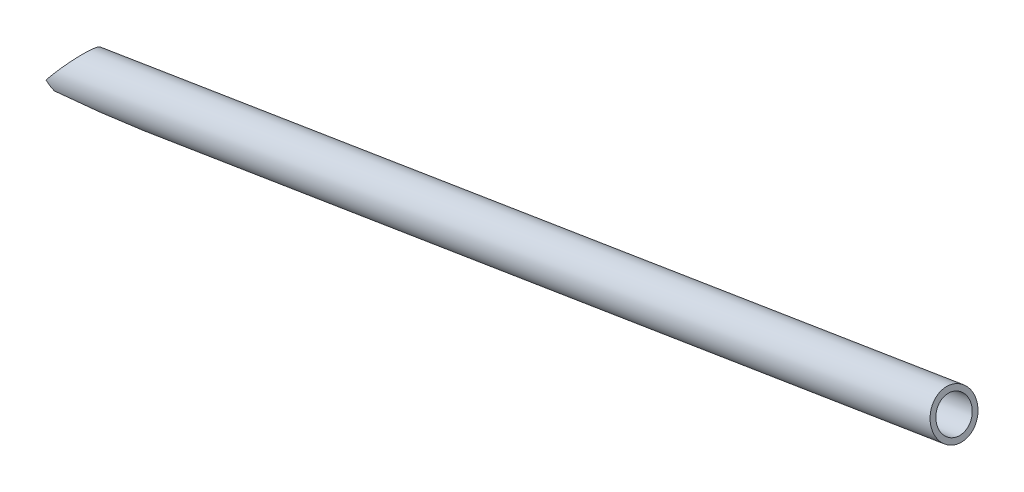
ISO-10303-21;
HEADER;
FILE_DESCRIPTION(('STEP AP214'),'2;1');
FILE_NAME('part.step','',(''),(''),'','','');
FILE_SCHEMA(('AUTOMOTIVE_DESIGN { 1 0 10303 214 1 1 1 1 }'));
ENDSEC;
DATA;
#1=APPLICATION_CONTEXT('core data for automotive mechanical design processes');
#2=APPLICATION_PROTOCOL_DEFINITION('international standard','automotive_design',2000,#1);
#3=PRODUCT_CONTEXT('',#1,'mechanical');
#4=PRODUCT('Part','Part','',(#3));
#5=PRODUCT_RELATED_PRODUCT_CATEGORY('part','',(#4));
#6=PRODUCT_DEFINITION_FORMATION('','',#4);
#7=PRODUCT_DEFINITION_CONTEXT('part definition',#1,'design');
#8=PRODUCT_DEFINITION('design','',#6,#7);
#9=PRODUCT_DEFINITION_SHAPE('','',#8);
#10=(LENGTH_UNIT() NAMED_UNIT(*) SI_UNIT(.MILLI.,.METRE.));
#11=(NAMED_UNIT(*) PLANE_ANGLE_UNIT() SI_UNIT($,.RADIAN.));
#12=(NAMED_UNIT(*) SI_UNIT($,.STERADIAN.) SOLID_ANGLE_UNIT());
#13=UNCERTAINTY_MEASURE_WITH_UNIT(LENGTH_MEASURE(1.E-05),#10,'distance_accuracy_value','');
#14=(GEOMETRIC_REPRESENTATION_CONTEXT(3) GLOBAL_UNCERTAINTY_ASSIGNED_CONTEXT((#13)) GLOBAL_UNIT_ASSIGNED_CONTEXT((#10,
#11,#12)) REPRESENTATION_CONTEXT('',''));
#15=CARTESIAN_POINT('',(0.,0.,0.));
#16=DIRECTION('',(0.,0.,1.));
#17=DIRECTION('',(1.,0.,0.));
#18=AXIS2_PLACEMENT_3D('',#15,#16,#17);
#19=CARTESIAN_POINT('',(1.11022302462516E-13,0.,200.));
#20=DIRECTION('',(0.974346253790714,0.214414809831036,0.0683788494281786));
#21=DIRECTION('',(-0.214917840654041,0.976632132263016,0.));
#22=AXIS2_PLACEMENT_3D('',#19,#20,#21);
#23=CYLINDRICAL_SURFACE('',#22,9.64999999999999);
#24=CARTESIAN_POINT('',(12.657848165168,12.6663837757625,201.033866445705));
#25=CARTESIAN_POINT('',(12.6754852969952,12.670267892202,200.817962669183));
#26=CARTESIAN_POINT('',(12.687592032191,12.6654475263971,200.601479552875));
#27=CARTESIAN_POINT('',(12.7007141875833,12.638523414575,200.169174249629));
#28=CARTESIAN_POINT('',(12.7017259689614,12.6164140008057,199.953352302735));
#29=CARTESIAN_POINT('',(12.6928978972254,12.5553665255426,199.524078278938));
#30=CARTESIAN_POINT('',(12.6830448100684,12.5164079759855,199.310629412783));
#31=CARTESIAN_POINT('',(12.6530021284405,12.4224960842971,198.888058418631));
#32=CARTESIAN_POINT('',(12.6328130614765,12.3675435584958,198.678936070393));
#33=CARTESIAN_POINT('',(12.5830320600362,12.243184894706,198.268006854536));
#34=CARTESIAN_POINT('',(12.5535148210002,12.1738950347901,198.066155597168));
#35=CARTESIAN_POINT('',(12.4858919172012,12.0217614179797,197.669092329484));
#36=CARTESIAN_POINT('',(12.447782977421,11.9389124958994,197.473882883662));
#37=CARTESIAN_POINT('',(12.3219341907085,11.6717883085674,196.89946271389));
#38=CARTESIAN_POINT('',(12.2226442596147,11.468867642128,196.531241749801));
#39=CARTESIAN_POINT('',(12.0316060655805,11.0842553958153,195.925453749268));
#40=CARTESIAN_POINT('',(11.9453209343831,10.91212601697,195.679846866211));
#41=CARTESIAN_POINT('',(11.7633134569783,10.5493905147042,195.206391270707));
#42=CARTESIAN_POINT('',(11.6675910839366,10.3587843387457,194.978542608757));
#43=CARTESIAN_POINT('',(11.4690610515366,9.96101997894277,194.540268125786));
#44=CARTESIAN_POINT('',(11.3662391268434,9.75382832807187,194.329879370938));
#45=CARTESIAN_POINT('',(11.1561166203957,9.32502507307062,193.926888893094));
#46=CARTESIAN_POINT('',(11.0488165553767,9.10341513103559,193.734285126072));
#47=CARTESIAN_POINT('',(10.8289801630034,8.64046845812747,193.361372645541));
#48=CARTESIAN_POINT('',(10.7163820687469,8.39874712577531,193.181578732136));
#49=CARTESIAN_POINT('',(10.4916151560703,7.90231270031796,192.840551125452));
#50=CARTESIAN_POINT('',(10.3794463991996,7.64759781431844,192.67932000358));
#51=CARTESIAN_POINT('',(10.1585685259634,7.12595405745613,192.375783109446));
#52=CARTESIAN_POINT('',(10.0498570573465,6.85903380588485,192.233464250728));
#53=CARTESIAN_POINT('',(9.83922076496434,6.31316264002374,191.968289535191));
#54=CARTESIAN_POINT('',(9.73729399139708,6.03421522043333,191.845428072539));
#55=CARTESIAN_POINT('',(9.57047290019094,5.54167367208223,191.650883437746));
#56=CARTESIAN_POINT('',(9.50303018067841,5.33086341131199,191.57435553236));
#57=CARTESIAN_POINT('',(9.37581635364825,4.90317076918427,191.433023906388));
#58=CARTESIAN_POINT('',(9.31604509781582,4.68628850531749,191.368219959128));
#59=CARTESIAN_POINT('',(9.15160880875329,4.02730802877123,191.192962312236));
#60=CARTESIAN_POINT('',(9.06144948682961,3.57583876087093,191.101244616923));
#61=CARTESIAN_POINT('',(8.97577033685186,2.93201498308204,191.015197637156));
#62=CARTESIAN_POINT('',(8.95588857677276,2.74596800194406,190.995420446076));
#63=CARTESIAN_POINT('',(8.92662025858535,2.37226878285702,190.966401216281));
#64=CARTESIAN_POINT('',(8.91722787463907,2.18461749436526,190.957153329495));
#65=CARTESIAN_POINT('',(8.9097824107179,1.80905100842609,190.949817507622));
#66=CARTESIAN_POINT('',(8.91171782718196,1.6211362723883,190.951718250927));
#67=CARTESIAN_POINT('',(8.92731018355185,1.24625414074607,190.967101487222));
#68=CARTESIAN_POINT('',(8.94096712902547,1.05928674559166,190.980583985713));
#69=CARTESIAN_POINT('',(8.97991455492612,0.687489382956031,191.01936046835));
#70=CARTESIAN_POINT('',(9.00522424573735,0.502663463668033,191.044673957779));
#71=CARTESIAN_POINT('',(9.06681305387757,0.136872736743957,191.10703570765));
#72=CARTESIAN_POINT('',(9.1030922202112,-0.0440920536391802,191.144084020517));
#73=CARTESIAN_POINT('',(9.18555958718107,-0.401254556927476,191.229651059047));
#74=CARTESIAN_POINT('',(9.23176218203105,-0.577444921801709,191.278186457591));
#75=CARTESIAN_POINT('',(9.33263534026653,-0.923960892723459,191.38621015946));
#76=CARTESIAN_POINT('',(9.38730810309086,-1.09428496139519,191.445701308411));
#77=CARTESIAN_POINT('',(9.52087381528293,-1.4782069213988,191.594307053623));
#78=CARTESIAN_POINT('',(9.60213445933264,-1.68961151358125,191.686970030302));
#79=CARTESIAN_POINT('',(9.77298568619439,-2.10101241056311,191.888514167262));
#80=CARTESIAN_POINT('',(9.86257895681247,-2.30100500046087,191.997400567503));
#81=CARTESIAN_POINT('',(10.0471440872052,-2.68964539689294,192.230379286382));
#82=CARTESIAN_POINT('',(10.1421222750033,-2.87827929544429,192.35448970323));
#83=CARTESIAN_POINT('',(10.3346687900217,-3.24398655328794,192.616836779603));
#84=CARTESIAN_POINT('',(10.432236937378,-3.42106071242621,192.755072460068));
#85=CARTESIAN_POINT('',(10.6302469377256,-3.76832748768761,193.048738097051));
#86=CARTESIAN_POINT('',(10.7306961138509,-3.93821118703156,193.204527959343));
#87=CARTESIAN_POINT('',(10.9296761212004,-4.26593746353563,193.529414802733));
#88=CARTESIAN_POINT('',(11.0282069546279,-4.42378005452549,193.698511768547));
#89=CARTESIAN_POINT('',(11.221393921876,-4.72732273014252,194.049334917178));
#90=CARTESIAN_POINT('',(11.3160502341815,-4.87302337442551,194.231060517198));
#91=CARTESIAN_POINT('',(11.4997202170597,-5.15204586566136,194.6064747587));
#92=CARTESIAN_POINT('',(11.5887337870685,-5.28536749201734,194.800163613268));
#93=CARTESIAN_POINT('',(11.7745249052481,-5.56162127137581,195.233914899582));
#94=CARTESIAN_POINT('',(11.8699109411979,-5.70211401694958,195.476138738318));
#95=CARTESIAN_POINT('',(12.048162615045,-5.96464239802318,195.974840419486));
#96=CARTESIAN_POINT('',(12.1310267599506,-6.08667583261123,196.231319956655));
#97=CARTESIAN_POINT('',(12.2819546322827,-6.31124777852025,196.756808713));
#98=CARTESIAN_POINT('',(12.35002236117,-6.41379155957007,197.025814520688));
#99=CARTESIAN_POINT('',(12.4693686655423,-6.59834253262544,197.574386494805));
#100=CARTESIAN_POINT('',(12.5206497605536,-6.68035280609528,197.853951069424));
#101=CARTESIAN_POINT('',(12.6010833501426,-6.81660628665564,198.396496064464));
#102=CARTESIAN_POINT('',(12.6317752082778,-6.87264686504241,198.65879763247));
#103=CARTESIAN_POINT('',(12.6768028120194,-6.96610068542239,199.188093314851));
#104=CARTESIAN_POINT('',(12.6911393670858,-7.00351484922619,199.455087196329));
#105=CARTESIAN_POINT('',(12.7028257800838,-7.05920581180806,199.991257529388));
#106=CARTESIAN_POINT('',(12.7001870149056,-7.07749541834401,200.260432398458));
#107=CARTESIAN_POINT('',(12.6777224541967,-7.09472605759301,200.798676180139));
#108=CARTESIAN_POINT('',(12.6578980603119,-7.09366866808983,201.067745099601));
#109=CARTESIAN_POINT('',(12.6043015208981,-7.07337718559519,201.574620264416));
#110=CARTESIAN_POINT('',(12.5722488163337,-7.05610016870809,201.812690956057));
#111=CARTESIAN_POINT('',(12.4950285866947,-7.0063320831581,202.285064966595));
#112=CARTESIAN_POINT('',(12.4498622194777,-6.97384235753062,202.519368616172));
#113=CARTESIAN_POINT('',(12.3470733567039,-6.89399113972104,202.982629751483));
#114=CARTESIAN_POINT('',(12.2894511612864,-6.84663000587242,203.211587365888));
#115=CARTESIAN_POINT('',(12.1626131988353,-6.73749471041387,203.662752495432));
#116=CARTESIAN_POINT('',(12.0933969981372,-6.67572000964217,203.884959757711));
#117=CARTESIAN_POINT('',(11.9436778465763,-6.53762710135798,204.323513792904));
#118=CARTESIAN_POINT('',(11.8630714479886,-6.46117299157532,204.539782321164));
#119=CARTESIAN_POINT('',(11.692289550137,-6.29471221418746,204.963110304137));
#120=CARTESIAN_POINT('',(11.6021140777158,-6.20470558459893,205.170169784681));
#121=CARTESIAN_POINT('',(11.4134646716672,-6.01169492196573,205.574276913209));
#122=CARTESIAN_POINT('',(11.3149883085275,-5.90868707929612,205.771321602816));
#123=CARTESIAN_POINT('',(11.1111357691073,-5.69022619477957,206.154656715818));
#124=CARTESIAN_POINT('',(11.0057589196984,-5.57477193809845,206.340946086708));
#125=CARTESIAN_POINT('',(10.7777141657784,-5.31856774651254,206.722010309178));
#126=CARTESIAN_POINT('',(10.6544168322438,-5.17643226006651,206.915478172531));
#127=CARTESIAN_POINT('',(10.4032278554856,-4.87788113941168,207.28788763306));
#128=CARTESIAN_POINT('',(10.2753357011349,-4.72146391350242,207.466827606892));
#129=CARTESIAN_POINT('',(10.0171562660308,-4.39453630523217,207.809780975575));
#130=CARTESIAN_POINT('',(9.88686728586113,-4.2240155980851,207.973783247038));
#131=CARTESIAN_POINT('',(9.62652996395328,-3.86910352104385,208.286208382021));
#132=CARTESIAN_POINT('',(9.49648159627687,-3.68471374773046,208.434633034108));
#133=CARTESIAN_POINT('',(9.25361789511525,-3.32302093532176,208.699957780578));
#134=CARTESIAN_POINT('',(9.14047787128656,-3.14716168728862,208.81852989279));
#135=CARTESIAN_POINT('',(8.91901082493826,-2.78429490902679,209.042457426952));
#136=CARTESIAN_POINT('',(8.81068394129518,-2.59728705748459,209.147812467701));
#137=CARTESIAN_POINT('',(8.60171787932793,-2.21240262403463,209.344571447791));
#138=CARTESIAN_POINT('',(8.50106667414862,-2.01454391683933,209.435997446312));
#139=CARTESIAN_POINT('',(8.31033157004587,-1.60787973124984,209.604404048217));
#140=CARTESIAN_POINT('',(8.22024453856257,-1.3990775246041,209.681388937858));
#141=CARTESIAN_POINT('',(8.07219799572401,-1.01814953533025,209.804936372095));
#142=CARTESIAN_POINT('',(8.01152738662136,-0.848036954497815,209.854467253069));
#143=CARTESIAN_POINT('',(7.90019825042097,-0.502123554917211,209.943941452427));
#144=CARTESIAN_POINT('',(7.84953721424909,-0.326324174555271,209.983887174039));
#145=CARTESIAN_POINT('',(7.75968346630133,0.0298789983831765,210.053882904637));
#146=CARTESIAN_POINT('',(7.7204761110397,0.210276588312629,210.083945555312));
#147=CARTESIAN_POINT('',(7.65452056150057,0.574711547408665,210.134102751716));
#148=CARTESIAN_POINT('',(7.62777240264866,0.758748926922818,210.154197269102));
#149=CARTESIAN_POINT('',(7.58729736710546,1.12933701155678,210.184476530198));
#150=CARTESIAN_POINT('',(7.57359003057456,1.31589106480192,210.194646403566));
#151=CARTESIAN_POINT('',(7.55928496846903,1.68976150279357,210.205257868046));
#152=CARTESIAN_POINT('',(7.55868719735125,1.87707788488945,210.205699492955));
#153=CARTESIAN_POINT('',(7.57007812713593,2.25126812774638,210.197252738259));
#154=CARTESIAN_POINT('',(7.58207838098105,2.43814142453817,210.188355794777));
#155=CARTESIAN_POINT('',(7.61773354362025,2.81021036406976,210.161723258219));
#156=CARTESIAN_POINT('',(7.64139531066782,2.99540495419567,210.143982463916));
#157=CARTESIAN_POINT('',(7.71032373626974,3.43413181077307,210.091751442174));
#158=CARTESIAN_POINT('',(7.76040396532063,3.68645830062254,210.053439615003));
#159=CARTESIAN_POINT('',(7.87712333147059,4.1844542800869,209.962247733673));
#160=CARTESIAN_POINT('',(7.94376372615572,4.43012326255573,209.909366573079));
#161=CARTESIAN_POINT('',(8.09048153877835,4.91483857610279,209.789947598085));
#162=CARTESIAN_POINT('',(8.17059998894754,5.15386200490303,209.723367937953));
#163=CARTESIAN_POINT('',(8.34116361501561,5.62413483013557,209.577452321735));
#164=CARTESIAN_POINT('',(8.43160870112228,5.85538429414147,209.498116476565));
#165=CARTESIAN_POINT('',(8.66224985763888,6.41106151823796,209.289197596));
#166=CARTESIAN_POINT('',(8.80669543990857,6.73123636832925,209.152951333516));
#167=CARTESIAN_POINT('',(9.10574976650321,7.35491620776174,208.855499648973));
#168=CARTESIAN_POINT('',(9.26036331945248,7.65841318346253,208.694282368093));
#169=CARTESIAN_POINT('',(9.57466628494203,8.24772414482963,208.34689305478));
#170=CARTESIAN_POINT('',(9.73435274415617,8.53354814371304,208.16073534609));
#171=CARTESIAN_POINT('',(10.0545253322407,9.08619591870411,207.762841654706));
#172=CARTESIAN_POINT('',(10.2150110783647,9.35302799910387,207.551116961846));
#173=CARTESIAN_POINT('',(10.4931035163631,9.80155444800179,207.157339786608));
#174=CARTESIAN_POINT('',(10.611422455241,9.98788573232563,206.981055422251));
#175=CARTESIAN_POINT('',(10.8444945432767,10.3472860038503,206.613194308935));
#176=CARTESIAN_POINT('',(10.9592477346205,10.5203551479894,206.421617740993));
#177=CARTESIAN_POINT('',(11.1831567308115,10.8512977391196,206.02321751645));
#178=CARTESIAN_POINT('',(11.2923203442298,11.0091926707726,205.816416171779));
#179=CARTESIAN_POINT('',(11.5031998383121,11.3079908568909,205.387344787793));
#180=CARTESIAN_POINT('',(11.6049184595258,11.4489003762788,205.165080499853));
#181=CARTESIAN_POINT('',(11.7768359798297,11.6816923565197,204.757456260285));
#182=CARTESIAN_POINT('',(11.8489604874108,11.7774553331454,204.575119144998));
#183=CARTESIAN_POINT('',(11.9863896171809,11.9561724531027,204.201901159135));
#184=CARTESIAN_POINT('',(12.0516980845563,12.0391338310809,204.011025193433));
#185=CARTESIAN_POINT('',(12.1743843772026,12.1909637141055,203.621597467278));
#186=CARTESIAN_POINT('',(12.231773473511,12.2598523164121,203.423057141255));
#187=CARTESIAN_POINT('',(12.3376871344589,12.3824764680831,203.019116826723));
#188=CARTESIAN_POINT('',(12.3862146464146,12.4362170588403,202.813719145917));
#189=CARTESIAN_POINT('',(12.4834127196024,12.5378845454177,202.349994413075));
#190=CARTESIAN_POINT('',(12.5296171657237,12.5817252761047,202.090232671769));
#191=CARTESIAN_POINT('',(12.605966980083,12.6435840389845,201.565230314472));
#192=CARTESIAN_POINT('',(12.6361087155118,12.6615962312443,201.299988473157));
#193=CARTESIAN_POINT('',(12.657848165168,12.6663837757625,201.033866445705));
#194=B_SPLINE_CURVE_WITH_KNOTS('',3,(#24,#25,#26,#27,#28,#29,#30,#31,#32,#33,#34,#35,#36,#37,
#38,#39,#40,#41,#42,#43,#44,#45,#46,#47,#48,#49,#50,#51,#52,#53,#54,#55,#56,#57,#58,#59,#60,#61,
#62,#63,#64,#65,#66,#67,#68,#69,#70,#71,#72,#73,#74,#75,#76,#77,#78,#79,#80,#81,#82,#83,#84,#85,
#86,#87,#88,#89,#90,#91,#92,#93,#94,#95,#96,#97,#98,#99,#100,#101,#102,#103,#104,#105,#106,#107,
#108,#109,#110,#111,#112,#113,#114,#115,#116,#117,#118,#119,#120,#121,#122,#123,#124,#125,#126,
#127,#128,#129,#130,#131,#132,#133,#134,#135,#136,#137,#138,#139,#140,#141,#142,#143,#144,#145,
#146,#147,#148,#149,#150,#151,#152,#153,#154,#155,#156,#157,#158,#159,#160,#161,#162,#163,#164,
#165,#166,#167,#168,#169,#170,#171,#172,#173,#174,#175,#176,#177,#178,#179,#180,#181,#182,#183,
#184,#185,#186,#187,#188,#189,#190,#191,#192,#193),.UNSPECIFIED.,.T.,.F.,(4,2,2,2,2,2,2,2,2,2,2,
2,2,2,2,2,2,2,2,2,2,2,2,2,2,2,2,2,2,2,2,2,2,2,2,2,2,2,2,2,2,2,2,2,2,2,2,2,2,2,2,2,2,2,2,2,2,2,2,
2,2,2,2,2,2,2,2,2,2,2,2,2,2,2,2,2,2,2,2,2,2,2,2,2,4),(0.,0.649678992547228,1.29957105431823,
1.95025559778301,2.60090693623045,3.24647484049866,3.8922892421184,5.18323403228391,
6.11839408192941,7.05355679074251,7.99065653809302,8.92764845027619,9.89166374666569,
10.8558124228479,11.8192904374071,12.7824903591283,13.4845685095807,14.1866330844921,
15.5872517432656,16.1512443575714,16.7149235722867,17.2780304612016,17.8411376175953,
18.4051764388978,18.9692177800052,19.5340828721208,20.0990948887177,20.8321251409705,
21.5653926679852,22.2995405038224,23.0336374882595,23.7872874320547,24.5409365102368,
25.2945508314175,26.048178579598,26.9344668093368,27.820860628459,28.7070144371056,
29.5930351807991,30.4018162261614,31.2105572414324,32.0187562935107,32.8268894357359,
33.5485495749332,34.2701460152548,34.9917250697092,35.7133311202733,36.4419715064427,
37.1706098487146,37.8994621949661,38.6283857454848,39.4371826220439,40.2460697493337,
41.0555543738144,41.8649459541521,42.5854928993547,43.3060606214649,44.0254750579606,
44.744675626512,45.3059654547501,45.8671144068969,46.4275427606506,46.9879727078769,
47.5492410779597,48.1105074981735,48.6722890743507,49.2344014349021,50.0134203547476,
50.7924984517109,51.5739927599809,52.3554802735155,53.4842022198906,54.6134618530179,
55.7420756899369,56.8701929650849,57.7169724226869,58.5637418583223,59.4092941505477,
60.2545336075759,60.9086048036489,61.5623049958734,62.2150650133965,62.8676075293849,
63.6682179517075,64.4690093666343),.UNSPECIFIED.);
#195=CARTESIAN_POINT('',(12.1046465312167,12.1046465312168,203.842854714181));
#196=VERTEX_POINT('',#195);
#197=CARTESIAN_POINT('',(12.6676672933684,12.6676672933683,200.905651889264));
#198=VERTEX_POINT('',#197);
#199=EDGE_CURVE('E106',#196,#198,#194,.T.);
#200=ORIENTED_EDGE('',*,*,#199,.T.);
#201=CARTESIAN_POINT('',(12.620043989875,12.6580645822266,201.031213378585));
#202=CARTESIAN_POINT('',(12.7011049108782,12.6759016546251,200.812254118165));
#203=CARTESIAN_POINT('',(12.7914335437327,12.687769201916,200.596224647645));
#204=CARTESIAN_POINT('',(12.9898665766632,12.70060598483,200.172153765622));
#205=CARTESIAN_POINT('',(13.0979731689363,12.7015738753942,199.964113343154));
#206=CARTESIAN_POINT('',(13.3310116553986,12.6939256763454,199.557762682774));
#207=CARTESIAN_POINT('',(13.4559511701165,12.6853052330426,199.359456907692));
#208=CARTESIAN_POINT('',(13.7213853969213,12.6599718973868,198.974131623141));
#209=CARTESIAN_POINT('',(13.8618798377827,12.6432591461194,198.787111916967));
#210=CARTESIAN_POINT('',(14.1558258223762,12.6034798585235,198.42682068598));
#211=CARTESIAN_POINT('',(14.3091643981065,12.5804653612168,198.253450919068));
#212=CARTESIAN_POINT('',(14.6282879120923,12.5295412257372,197.919334790823));
#213=CARTESIAN_POINT('',(14.7940749615075,12.5016307561701,197.758590580183));
#214=CARTESIAN_POINT('',(15.1365153772848,12.4423398192595,197.449924057493));
#215=CARTESIAN_POINT('',(15.3131669132212,12.4109599357288,197.301999595661));
#216=CARTESIAN_POINT('',(15.6758690778789,12.3459751212025,197.018725223121));
#217=CARTESIAN_POINT('',(15.8619208063878,12.3123699297107,196.883376789046));
#218=CARTESIAN_POINT('',(16.3669622671071,12.2215492114273,196.539795680015));
#219=CARTESIAN_POINT('',(16.6929775468031,12.1633283877218,196.342106418799));
#220=CARTESIAN_POINT('',(17.3614988574842,12.0474048314355,195.976721993107));
#221=CARTESIAN_POINT('',(17.7040156224495,11.9897024658632,195.809046695959));
#222=CARTESIAN_POINT('',(18.4019417397982,11.8770053187344,195.499563329936));
#223=CARTESIAN_POINT('',(18.7573812885607,11.8220176951014,195.357821229533));
#224=CARTESIAN_POINT('',(19.2969860265838,11.742690852784,195.162221674115));
#225=CARTESIAN_POINT('',(19.4779137841571,11.7167762835371,195.099861727722));
#226=CARTESIAN_POINT('',(19.8416496874136,11.6660787451101,194.980355476696));
#227=CARTESIAN_POINT('',(20.0244578767474,11.6412958022716,194.923209293396));
#228=CARTESIAN_POINT('',(20.4669346012247,11.5830171428112,194.791271829278));
#229=CARTESIAN_POINT('',(20.7273884823323,11.5501147787187,194.718851267627));
#230=CARTESIAN_POINT('',(21.2508161905557,11.4867850439317,194.582492435687));
#231=CARTESIAN_POINT('',(21.5137903064362,11.4563579607344,194.518555150166));
#232=CARTESIAN_POINT('',(22.3059012096734,11.3687987235344,194.33797605011));
#233=CARTESIAN_POINT('',(22.8380413060767,11.3154129306822,194.232620587775));
#234=CARTESIAN_POINT('',(23.9083522653449,11.2180903387045,194.045552342472));
#235=CARTESIAN_POINT('',(24.4465335603296,11.1741739103364,193.963890401862));
#236=CARTESIAN_POINT('',(25.5259509626393,11.0950921227115,193.819735733581));
#237=CARTESIAN_POINT('',(26.0671864792065,11.0599251266945,193.757239420078));
#238=CARTESIAN_POINT('',(27.1568046259864,10.9971078886399,193.647233819924));
#239=CARTESIAN_POINT('',(27.7052062009246,10.9695325055586,193.599873095669));
#240=CARTESIAN_POINT('',(28.803280363578,10.9214120830822,193.518102800346));
#241=CARTESIAN_POINT('',(29.3529530019692,10.9008673290313,193.48369375493));
#242=CARTESIAN_POINT('',(30.4521597252462,10.8659805274535,193.425686151952));
#243=CARTESIAN_POINT('',(31.0016925955854,10.8516284987607,193.402070194895));
#244=CARTESIAN_POINT('',(31.8262867087074,10.8341472031244,193.3734345105));
#245=CARTESIAN_POINT('',(32.1011955943554,10.8289946188342,193.365020747966));
#246=CARTESIAN_POINT('',(32.6510907105645,10.8199531419688,193.350286524879));
#247=CARTESIAN_POINT('',(32.9260769412089,10.8160642507578,193.343966066585));
#248=CARTESIAN_POINT('',(33.8274299709977,10.8052535340101,193.326416646981));
#249=CARTESIAN_POINT('',(34.4539084471166,10.800803785453,193.319232028569));
#250=CARTESIAN_POINT('',(35.7069286245605,10.7971699974182,193.313362520485));
#251=CARTESIAN_POINT('',(36.3334703273266,10.7979861410617,193.314677926401));
#252=CARTESIAN_POINT('',(37.5865422582679,10.8041540264702,193.324650676474));
#253=CARTESIAN_POINT('',(38.2130724765071,10.8095062993711,193.3333088804));
#254=CARTESIAN_POINT('',(39.4659697149193,10.8241207724621,193.357063787348));
#255=CARTESIAN_POINT('',(40.0923367326504,10.833383028132,193.372160581729));
#256=CARTESIAN_POINT('',(41.3452212377135,10.8552856696738,193.408094711351));
#257=CARTESIAN_POINT('',(41.9717385894931,10.8679280810037,193.428935488735));
#258=CARTESIAN_POINT('',(43.2245154949822,10.8961264719018,193.475800885791));
#259=CARTESIAN_POINT('',(43.8507750466388,10.9116824742382,193.501825545973));
#260=CARTESIAN_POINT('',(45.7290410757312,10.9620996848237,193.586987537786));
#261=CARTESIAN_POINT('',(46.9806293738712,11.000711875698,193.65321573404));
#262=CARTESIAN_POINT('',(49.488866681828,11.0854972291692,193.802488047415));
#263=CARTESIAN_POINT('',(50.7455093792145,11.1317075429858,193.885615290168));
#264=CARTESIAN_POINT('',(53.2575065341837,11.2294623930587,194.067058070909));
#265=CARTESIAN_POINT('',(54.5128609703912,11.2810070164226,194.165373856935));
#266=CARTESIAN_POINT('',(57.0213089495712,11.3876841382525,194.37642203733));
#267=CARTESIAN_POINT('',(58.2744034622621,11.4428140836502,194.489144227088));
#268=CARTESIAN_POINT('',(60.7791004298145,11.5552442672746,194.728958346723));
#269=CARTESIAN_POINT('',(62.0307029068714,11.6125444727906,194.856050060076));
#270=CARTESIAN_POINT('',(64.5162620623405,11.7272722390065,195.123323260433));
#271=CARTESIAN_POINT('',(65.7502394878734,11.7846887752327,195.263316311444));
#272=CARTESIAN_POINT('',(68.2164221945584,11.8991618836708,195.558709076989));
#273=CARTESIAN_POINT('',(69.448627403064,11.9562184414338,195.714109405807));
#274=CARTESIAN_POINT('',(71.9128542946784,12.06880183938,196.042202061149));
#275=CARTESIAN_POINT('',(73.1448724189605,12.124326040321,196.214922104081));
#276=CARTESIAN_POINT('',(75.6060086894885,12.2323104801192,196.579922978919));
#277=CARTESIAN_POINT('',(76.8351271928523,12.2847711174665,196.772201257844));
#278=CARTESIAN_POINT('',(78.6714647889444,12.3596077793001,197.07751932193));
#279=CARTESIAN_POINT('',(79.2800882229205,12.3838273601087,197.181687495984));
#280=CARTESIAN_POINT('',(80.4962436084782,12.4307698564265,197.396526360655));
#281=CARTESIAN_POINT('',(81.103775568745,12.4534927838968,197.507196999294));
#282=CARTESIAN_POINT('',(82.3178420156585,12.4971082490062,197.735964964401));
#283=CARTESIAN_POINT('',(82.9243758071853,12.5179998149018,197.85406617722));
#284=CARTESIAN_POINT('',(84.1357862476589,12.5574978531028,198.098784613669));
#285=CARTESIAN_POINT('',(84.7406629434838,12.5761043907165,198.225401593749));
#286=CARTESIAN_POINT('',(85.9467426284785,12.6104112100736,198.488349491287));
#287=CARTESIAN_POINT('',(86.5479510853667,12.6261189494415,198.624654196361));
#288=CARTESIAN_POINT('',(87.7475528850386,12.6538956106294,198.909405041617));
#289=CARTESIAN_POINT('',(88.3459463623266,12.6659647080844,199.057850595327));
#290=CARTESIAN_POINT('',(89.5383961259025,12.6853253375005,199.369860371109));
#291=CARTESIAN_POINT('',(90.1324555689776,12.6926207827083,199.533412083925));
#292=CARTESIAN_POINT('',(91.0190607766114,12.6986207468649,199.793864821244));
#293=CARTESIAN_POINT('',(91.3138169635793,12.6997970072657,199.883192809648));
#294=CARTESIAN_POINT('',(91.9014438977332,12.7001557855584,200.067836403176));
#295=CARTESIAN_POINT('',(92.1943147686565,12.6993384356608,200.163151610835));
#296=CARTESIAN_POINT('',(92.6320237622012,12.6962724103193,200.311625761075));
#297=CARTESIAN_POINT('',(92.7777876525651,12.6949417587811,200.362080696488));
#298=CARTESIAN_POINT('',(93.0686058920459,12.6915884535534,200.465012876613));
#299=CARTESIAN_POINT('',(93.2136601846536,12.6895657456329,200.517490279524));
#300=CARTESIAN_POINT('',(93.503011924647,12.684738794633,200.624730847925));
#301=CARTESIAN_POINT('',(93.6473088620541,12.6819340803061,200.679495374694));
#302=CARTESIAN_POINT('',(93.9348789972121,12.6754307640026,200.791575045197));
#303=CARTESIAN_POINT('',(94.0781522154095,12.6717321799309,200.848890137823));
#304=CARTESIAN_POINT('',(94.5073158428592,12.6590756611886,201.025628169736));
#305=CARTESIAN_POINT('',(94.7914124462141,12.6485739563349,201.149428357768));
#306=CARTESIAN_POINT('',(95.2117127587467,12.6285518676322,201.346847618912));
#307=CARTESIAN_POINT('',(95.3507885674303,12.6211697568837,201.414580074814));
#308=CARTESIAN_POINT('',(95.6264402059916,12.6046728101247,201.554740857161));
#309=CARTESIAN_POINT('',(95.7630164316214,12.5955582510557,201.627168431846));
#310=CARTESIAN_POINT('',(96.0344368840197,12.5750745596217,201.778597975394));
#311=CARTESIAN_POINT('',(96.1692420738786,12.5636802647255,201.857667025861));
#312=CARTESIAN_POINT('',(96.4342722517266,12.5380975026283,202.023151571204));
#313=CARTESIAN_POINT('',(96.564491826625,12.5239058555531,202.10957536241));
#314=CARTESIAN_POINT('',(96.8169212212189,12.4919959367344,202.290953893629));
#315=CARTESIAN_POINT('',(96.9391856784697,12.4743060887794,202.385836695308));
#316=CARTESIAN_POINT('',(97.1726959382639,12.4340968288029,202.587237196131));
#317=CARTESIAN_POINT('',(97.2839711173797,12.411590831813,202.693722181876));
#318=CARTESIAN_POINT('',(97.4544746248248,12.3684173441762,202.884155519667));
#319=CARTESIAN_POINT('',(97.5187568461126,12.349596299528,202.963936491618));
#320=CARTESIAN_POINT('',(97.6351243747555,12.3082612055481,203.131148688588));
#321=CARTESIAN_POINT('',(97.6872336961368,12.2857545787975,203.218564375844));
#322=CARTESIAN_POINT('',(97.7623855107158,12.2430482504843,203.376771777749));
#323=CARTESIAN_POINT('',(97.7894691322254,12.2238038757668,203.445872851365));
#324=CARTESIAN_POINT('',(97.8315604135547,12.1831189035385,203.587058294081));
#325=CARTESIAN_POINT('',(97.8465829361038,12.1616810458887,203.659138875985));
#326=CARTESIAN_POINT('',(97.8628142933741,12.1169048866653,203.804792070157));
#327=CARTESIAN_POINT('',(97.8639399066952,12.0935559778609,203.87837103066));
#328=CARTESIAN_POINT('',(97.8520082584352,12.0458693563997,204.02404281278));
#329=CARTESIAN_POINT('',(97.8389424548066,12.0215310567045,204.09613471268));
#330=CARTESIAN_POINT('',(97.7971777809222,11.9688136319221,204.247935359032));
#331=CARTESIAN_POINT('',(97.7663203831761,11.9404083411751,204.327028372059));
#332=CARTESIAN_POINT('',(97.6915877719453,11.8842331018887,204.479018427711));
#333=CARTESIAN_POINT('',(97.6476857607839,11.8564645892297,204.551902314365));
#334=CARTESIAN_POINT('',(97.5177557517464,11.7835782014713,204.738468214255));
#335=CARTESIAN_POINT('',(97.4232792671128,11.7393823649244,204.846536075369));
#336=CARTESIAN_POINT('',(97.2191718039851,11.6539769761827,205.048449458493));
#337=CARTESIAN_POINT('',(97.1094950339208,11.6127770436799,205.142250138293));
#338=CARTESIAN_POINT('',(96.8229194321126,11.5126527347987,205.363795426324));
#339=CARTESIAN_POINT('',(96.6401630822064,11.4553498239913,205.484594098153));
#340=CARTESIAN_POINT('',(96.2632459669298,11.3449620222257,205.70941228941));
#341=CARTESIAN_POINT('',(96.0690589777352,11.2918875444297,205.813390998201));
#342=CARTESIAN_POINT('',(95.6726481935831,11.1887075732416,206.009588460149));
#343=CARTESIAN_POINT('',(95.4703842336451,11.1386211374516,206.101735319405));
#344=CARTESIAN_POINT('',(95.0615166086385,11.0410972252149,206.276475110373));
#345=CARTESIAN_POINT('',(94.8549185214327,10.9936566008038,206.359079526695));
#346=CARTESIAN_POINT('',(94.4120323780163,10.8949616548562,206.526902241723));
#347=CARTESIAN_POINT('',(94.1753054688482,10.8439880018725,206.611120537573));
#348=CARTESIAN_POINT('',(93.6988781748563,10.7441718709007,206.772128446534));
#349=CARTESIAN_POINT('',(93.4591773329169,10.6953297258866,206.848916901254));
#350=CARTESIAN_POINT('',(92.9774295764434,10.5993978123228,206.996464244595));
#351=CARTESIAN_POINT('',(92.7353813623864,10.552309093607,207.06721955266));
#352=CARTESIAN_POINT('',(92.2495628032729,10.459648919872,207.203646589532));
#353=CARTESIAN_POINT('',(92.0057923660546,10.4140775468079,207.269318044002));
#354=CARTESIAN_POINT('',(91.2712112182395,10.2790989397647,207.460199051863));
#355=CARTESIAN_POINT('',(90.7783479224967,10.191666593002,207.578912002715));
#356=CARTESIAN_POINT('',(89.7891614493681,10.0209504775621,207.803224104744));
#357=CARTESIAN_POINT('',(89.2928394518356,9.9376653662246,207.90882751686));
#358=CARTESIAN_POINT('',(88.2969660078277,9.77438309858809,208.109759977936));
#359=CARTESIAN_POINT('',(87.7974114317796,9.69438995482751,208.205076705416));
#360=CARTESIAN_POINT('',(86.79627017556,9.53727761213236,208.387179397685));
#361=CARTESIAN_POINT('',(86.294683339015,9.46015863919451,208.473964692521));
#362=CARTESIAN_POINT('',(85.2907695696067,9.30855677205944,208.640220121633));
#363=CARTESIAN_POINT('',(84.7884451930023,9.23406976867785,208.719701999985));
#364=CARTESIAN_POINT('',(83.7825572952793,9.0873327445631,208.872518156812));
#365=CARTESIAN_POINT('',(83.2789938110271,9.01508265812478,208.945852615964));
#366=CARTESIAN_POINT('',(81.7731669518959,8.8022694185814,209.156962849293));
#367=CARTESIAN_POINT('',(80.769377560363,8.66468529111102,209.286880180394));
#368=CARTESIAN_POINT('',(78.75885496789,8.39639673654941,209.530119581309));
#369=CARTESIAN_POINT('',(77.752121616114,8.26569266872079,209.643440785057));
#370=CARTESIAN_POINT('',(75.7362387061998,8.0105177176464,209.856430380045));
#371=CARTESIAN_POINT('',(74.7270887321034,7.8860480025194,209.956096218731));
#372=CARTESIAN_POINT('',(72.7070008153684,7.64301623434054,210.143858108922));
#373=CARTESIAN_POINT('',(71.6960628548628,7.52445424067272,210.231954044142));
#374=CARTESIAN_POINT('',(69.6709426521024,7.29289795523545,210.398268299002));
#375=CARTESIAN_POINT('',(68.6567578270169,7.1799137424356,210.476469110024));
#376=CARTESIAN_POINT('',(66.6271098852402,6.95976575348964,210.623992111453));
#377=CARTESIAN_POINT('',(65.6116467629009,6.85260200315397,210.693314262489));
#378=CARTESIAN_POINT('',(63.5797324297953,6.64429714943566,210.823974443731));
#379=CARTESIAN_POINT('',(62.5632813733814,6.54315522331668,210.885313565989));
#380=CARTESIAN_POINT('',(60.5293571326168,6.34722202002142,211.000713358216));
#381=CARTESIAN_POINT('',(59.5118839502824,6.25243073034249,211.054774042515));
#382=CARTESIAN_POINT('',(57.4790528945009,6.06998848065954,211.155988774439));
#383=CARTESIAN_POINT('',(56.4636978881404,5.98231686129204,211.203163147082));
#384=CARTESIAN_POINT('',(54.4320869862138,5.81450417424946,211.291169771653));
#385=CARTESIAN_POINT('',(53.4158310882352,5.73436312680208,211.332002006546));
#386=CARTESIAN_POINT('',(51.3822688142994,5.58254677781397,211.407557140682));
#387=CARTESIAN_POINT('',(50.3649622792454,5.51087303938963,211.442278912474));
#388=CARTESIAN_POINT('',(48.3295236935387,5.37726830776598,211.505670408091));
#389=CARTESIAN_POINT('',(47.3113916484584,5.31533724934354,211.534340172432));
#390=CARTESIAN_POINT('',(45.2758766097926,5.20296998202875,211.585461145656));
#391=CARTESIAN_POINT('',(44.2584948172623,5.15251650530081,211.607921707289));
#392=CARTESIAN_POINT('',(42.222984543397,5.06520139724806,211.646287392872));
#393=CARTESIAN_POINT('',(41.2048560401801,5.02834018160028,211.66219231634));
#394=CARTESIAN_POINT('',(39.1683201819901,4.97119202438807,211.686669661113));
#395=CARTESIAN_POINT('',(38.1499130048381,4.9509000668733,211.695244301525));
#396=CARTESIAN_POINT('',(36.6221617987886,4.93598156073707,211.701542550909));
#397=CARTESIAN_POINT('',(36.112902935619,4.9335951394024,211.702548082283));
#398=CARTESIAN_POINT('',(35.0943951021102,4.93466917034953,211.702095890989));
#399=CARTESIAN_POINT('',(34.5851461317439,4.93812952838279,211.700638208028));
#400=CARTESIAN_POINT('',(33.667753240756,4.95033045347805,211.695480332548));
#401=CARTESIAN_POINT('',(33.2595908096299,4.95788752248339,211.692282303181));
#402=CARTESIAN_POINT('',(32.4433972599631,4.97773174248266,211.68384804187));
#403=CARTESIAN_POINT('',(32.0353661420498,4.99001891575172,211.67861180033));
#404=CARTESIAN_POINT('',(31.219436611981,5.01986993570448,211.66581205596));
#405=CARTESIAN_POINT('',(30.8115382518148,5.03743499343352,211.658248018994));
#406=CARTESIAN_POINT('',(29.9960892441026,5.07847193609837,211.64043063466));
#407=CARTESIAN_POINT('',(29.5885386000704,5.10194388003441,211.63017726043));
#408=CARTESIAN_POINT('',(28.7739552754402,5.15552740264646,211.606523944454));
#409=CARTESIAN_POINT('',(28.3669226004864,5.18563905306157,211.593123968711));
#410=CARTESIAN_POINT('',(27.5536259859555,5.25335327553754,211.562597552429));
#411=CARTESIAN_POINT('',(27.1473620228879,5.29095561483852,211.545471227678));
#412=CARTESIAN_POINT('',(26.3360146922367,5.37463238679717,211.506757136954));
#413=CARTESIAN_POINT('',(25.930931048063,5.42070463955227,211.485170518749));
#414=CARTESIAN_POINT('',(25.1223027882863,5.52247760129933,211.436582521925));
#415=CARTESIAN_POINT('',(24.7187581211499,5.57817798494321,211.409581326267));
#416=CARTESIAN_POINT('',(23.8242575613429,5.71414231601047,211.342204393308));
#417=CARTESIAN_POINT('',(23.3338284997149,5.79711414444239,211.300189580222));
#418=CARTESIAN_POINT('',(22.357881572172,5.98221454394821,211.203308272473));
#419=CARTESIAN_POINT('',(21.8723625954961,6.08433867537005,211.148444755508));
#420=CARTESIAN_POINT('',(21.1499268879832,6.25421676090301,211.053456522373));
#421=CARTESIAN_POINT('',(20.9101894199789,6.31359599573423,211.019695324988));
#422=CARTESIAN_POINT('',(20.4330314906374,6.43834502321326,210.947279893416));
#423=CARTESIAN_POINT('',(20.1956108315234,6.50371429947613,210.908626080898));
#424=CARTESIAN_POINT('',(19.7236957671805,6.64083284680703,210.82569885273));
#425=CARTESIAN_POINT('',(19.4892003084561,6.71257974065098,210.781427528369));
#426=CARTESIAN_POINT('',(19.0237410712168,6.86285212233356,210.686400720766));
#427=CARTESIAN_POINT('',(18.7927769078838,6.94137686527769,210.63564594977));
#428=CARTESIAN_POINT('',(18.2825980994924,7.12440706020905,210.514158972853));
#429=CARTESIAN_POINT('',(18.0044822474977,7.2307378881142,210.441515634362));
#430=CARTESIAN_POINT('',(17.4567161515844,7.45455990037431,210.282915090414));
#431=CARTESIAN_POINT('',(17.1870632947051,7.57204759402103,210.196962043964));
#432=CARTESIAN_POINT('',(16.6587830712606,7.81809323181714,210.00956079859));
#433=CARTESIAN_POINT('',(16.4001423298991,7.94663713891657,209.90813212456));
#434=CARTESIAN_POINT('',(15.8963538729728,8.21436521805563,209.687326605342));
#435=CARTESIAN_POINT('',(15.6512025534872,8.35354652416614,209.567954586131));
#436=CARTESIAN_POINT('',(15.2297584503878,8.60950026858462,209.337517664505));
#437=CARTESIAN_POINT('',(15.0501934589541,8.72445499674745,209.230415649967));
#438=CARTESIAN_POINT('',(14.7027567700797,8.95901035009921,209.002934380375));
#439=CARTESIAN_POINT('',(14.5348877642779,9.07861203490916,208.882552085441));
#440=CARTESIAN_POINT('',(14.2125600800004,9.32102491531088,208.627826554129));
#441=CARTESIAN_POINT('',(14.0581009688631,9.44383600718671,208.493483768485));
#442=CARTESIAN_POINT('',(13.764255342402,9.69085682174111,208.210513668636));
#443=CARTESIAN_POINT('',(13.6248613363562,9.81506581511142,208.061893523552));
#444=CARTESIAN_POINT('',(13.3613663447195,10.0639923655048,207.748958716728));
#445=CARTESIAN_POINT('',(13.2374090128104,10.1887049406458,207.584518722046));
#446=CARTESIAN_POINT('',(13.0074835470576,10.4352931716929,207.241495640006));
#447=CARTESIAN_POINT('',(12.9015160130618,10.5571687328854,207.062912081339));
#448=CARTESIAN_POINT('',(12.7086094673899,10.7957446943769,206.692562762327));
#449=CARTESIAN_POINT('',(12.6216654056888,10.9124464615505,206.500800518239));
#450=CARTESIAN_POINT('',(12.4675217238158,11.1384967833175,206.105384551824));
#451=CARTESIAN_POINT('',(12.4003193152687,11.247846374672,205.901732513725));
#452=CARTESIAN_POINT('',(12.293888275386,11.4430276189378,205.512522960485));
#453=CARTESIAN_POINT('',(12.2521037944246,11.5300387320101,205.328249914664));
#454=CARTESIAN_POINT('',(12.1838629592017,11.6959965038584,204.953349534111));
#455=CARTESIAN_POINT('',(12.1574052966893,11.7749438504592,204.762722743185));
#456=CARTESIAN_POINT('',(12.1199413504328,11.9238631684697,204.376563108601));
#457=CARTESIAN_POINT('',(12.1089313972989,11.9938372677608,204.181031441265));
#458=CARTESIAN_POINT('',(12.1023971605705,12.1241646562768,203.786526728716));
#459=CARTESIAN_POINT('',(12.1068732091131,12.1845177391252,203.587553609783));
#460=CARTESIAN_POINT('',(12.1311181507227,12.2943761635388,203.190629183932));
#461=CARTESIAN_POINT('',(12.1506676304034,12.3440241740435,202.992703895743));
#462=CARTESIAN_POINT('',(12.2047097751951,12.433365453792,202.596657716323));
#463=CARTESIAN_POINT('',(12.2392018110862,12.4730591420936,202.398536833678));
#464=CARTESIAN_POINT('',(12.3229706752704,12.542544025653,202.003689665928));
#465=CARTESIAN_POINT('',(12.3722476196043,12.5723351431855,201.80696339178));
#466=CARTESIAN_POINT('',(12.485333457562,12.6222952461847,201.416481899456));
#467=CARTESIAN_POINT('',(12.5491437332365,12.6424633159804,201.222726965712));
#468=CARTESIAN_POINT('',(12.620043989875,12.6580645822266,201.031213378585));
#469=B_SPLINE_CURVE_WITH_KNOTS('',3,(#201,#202,#203,#204,#205,#206,#207,#208,#209,#210,#211,
#212,#213,#214,#215,#216,#217,#218,#219,#220,#221,#222,#223,#224,#225,#226,#227,#228,#229,#230,
#231,#232,#233,#234,#235,#236,#237,#238,#239,#240,#241,#242,#243,#244,#245,#246,#247,#248,#249,
#250,#251,#252,#253,#254,#255,#256,#257,#258,#259,#260,#261,#262,#263,#264,#265,#266,#267,#268,
#269,#270,#271,#272,#273,#274,#275,#276,#277,#278,#279,#280,#281,#282,#283,#284,#285,#286,#287,
#288,#289,#290,#291,#292,#293,#294,#295,#296,#297,#298,#299,#300,#301,#302,#303,#304,#305,#306,
#307,#308,#309,#310,#311,#312,#313,#314,#315,#316,#317,#318,#319,#320,#321,#322,#323,#324,#325,
#326,#327,#328,#329,#330,#331,#332,#333,#334,#335,#336,#337,#338,#339,#340,#341,#342,#343,#344,
#345,#346,#347,#348,#349,#350,#351,#352,#353,#354,#355,#356,#357,#358,#359,#360,#361,#362,#363,
#364,#365,#366,#367,#368,#369,#370,#371,#372,#373,#374,#375,#376,#377,#378,#379,#380,#381,#382,
#383,#384,#385,#386,#387,#388,#389,#390,#391,#392,#393,#394,#395,#396,#397,#398,#399,#400,#401,
#402,#403,#404,#405,#406,#407,#408,#409,#410,#411,#412,#413,#414,#415,#416,#417,#418,#419,#420,
#421,#422,#423,#424,#425,#426,#427,#428,#429,#430,#431,#432,#433,#434,#435,#436,#437,#438,#439,
#440,#441,#442,#443,#444,#445,#446,#447,#448,#449,#450,#451,#452,#453,#454,#455,#456,#457,#458,
#459,#460,#461,#462,#463,#464,#465,#466,#467,#468),.UNSPECIFIED.,.T.,.F.,(4,2,2,2,2,2,2,2,2,2,2,
2,2,2,2,2,2,2,2,2,2,2,2,2,2,2,2,2,2,2,2,2,2,2,2,2,2,2,2,2,2,2,2,2,2,2,2,2,2,2,2,2,2,2,2,2,2,2,2,
2,2,2,2,2,2,2,2,2,2,2,2,2,2,2,2,2,2,2,2,2,2,2,2,2,2,2,2,2,2,2,2,2,2,2,2,2,2,2,2,2,2,2,2,2,2,2,2,
2,2,2,2,2,2,2,2,2,2,2,2,2,2,2,2,2,2,2,2,2,2,2,2,2,2,4),(0.,0.702248194127102,1.40458304737984,
2.10723693381695,2.80987857026238,3.50688431041088,4.2040085252009,4.90101561002054,
5.5981044317661,6.75321609638337,7.90908956626371,9.06786364487061,9.64715805296323,
10.226465938762,11.0432689526149,11.8601667008898,13.4945442868132,15.1324034677028,
16.7699560227822,18.4231205326611,20.07635212974,21.7269090752914,22.5521578257543,
23.3774074670206,25.2569082432589,27.1364743794276,29.0162606246461,30.8960735435816,
32.7770154190231,34.6579719936339,38.4196016639773,42.2002029211062,45.9808659241334,
49.7588656281356,53.5368084116608,57.266378690868,60.9960977269544,64.7318836146386,
68.4671824861792,70.3209979768955,72.1747986505013,74.029577094206,75.8843025141841,
77.734187730358,79.5839836393539,81.432261254552,82.3562007373485,83.2800789488027,
83.7428303028519,84.2056179273223,84.6686850387828,85.131742875483,86.0614907187733,
86.5260222525805,86.9904795907858,87.4603782966605,87.93081427013,88.3975742291317,
88.8630506028992,89.1748393290816,89.4860076810452,89.7151663720527,89.9440422386018,
90.1742880640845,90.4046725551614,90.6717521582119,90.9393842641972,91.3874129355242,
91.8368219032029,92.5144051304492,93.193608501856,93.8767611161459,94.5590827761173,
95.3280458859198,96.0971286926001,96.8666648033282,97.6362424111065,99.1792729269831,
100.721800597501,102.266155880351,103.810632341118,105.352580115181,106.894482554422,
109.95866232043,113.023001933221,116.087913573965,119.152856016794,122.223147965553,
125.293453528194,128.363338640805,131.433217709487,134.493844390491,137.554479292339,
140.615678325873,143.676856865101,146.733398995521,149.790034593026,152.845744523109,
154.373509830402,155.901250510754,157.125957238978,158.350669734692,159.575663463629,
160.800669428758,162.025688630184,163.250669772246,164.475336081029,165.699961014704,
167.197036366655,168.693765112946,169.441494232327,170.189158952578,170.93654614401,
171.683851300942,172.602757884771,173.521377906734,174.438848387609,175.356072548993,
176.071241089239,176.786573673837,177.5018831701,178.216835345396,178.938009770248,
179.659208237064,180.380215019582,181.101119915741,181.724397125221,182.347621125796,
182.970697063048,183.593786363846,184.20797314847,184.822134072659,185.436299817278,
186.050523990547),.UNSPECIFIED.);
#470=EDGE_CURVE('E59',#198,#196,#469,.T.);
#471=ORIENTED_EDGE('',*,*,#470,.T.);
#472=EDGE_LOOP('',(#200,#471));
#473=FACE_BOUND('',#472,.T.);
#474=CARTESIAN_POINT('',(549.76326332179,120.981001464959,238.581950982591));
#475=DIRECTION('',(0.949282258198062,0.310528416732881,0.0493487251279869));
#476=DIRECTION('',(0.296210008732026,-0.935849575324635,0.190906267816626));
#477=AXIS2_PLACEMENT_3D('',#474,#475,#476);
#478=ELLIPSE('',#477,9.6996046264727,9.64999999999999);
#479=CARTESIAN_POINT('',(552.636383292895,111.903630594458,240.433666301128));
#480=VERTEX_POINT('',#479);
#481=EDGE_CURVE('E44',#480,#480,#478,.T.);
#482=ORIENTED_EDGE('',*,*,#481,.T.);
#483=EDGE_LOOP('',(#482));
#484=FACE_BOUND('',#483,.T.);
#485=ADVANCED_FACE('F40',(#473,#484),#23,.F.);
#486=CARTESIAN_POINT('',(1.11022302462516E-13,0.,200.));
#487=DIRECTION('',(0.974346253790714,0.214414809831036,0.0683788494281786));
#488=DIRECTION('',(-0.214917840654041,0.976632132263016,0.));
#489=AXIS2_PLACEMENT_3D('',#486,#487,#488);
#490=CYLINDRICAL_SURFACE('',#489,12.7);
#491=CARTESIAN_POINT('',(0.,0.,200.));
#492=DIRECTION('',(-0.11325578618615,0.946595388418475,0.301877951364842));
#493=DIRECTION('',(0.993565864397201,0.107901658820134,0.0344108286518399));
#494=AXIS2_PLACEMENT_3D('',#491,#492,#493);
#495=ELLIPSE('',#494,112.135551106643,12.7);
#496=CARTESIAN_POINT('',(11.630689573576,5.10069211412612,188.369310426424));
#497=VERTEX_POINT('',#496);
#498=CARTESIAN_POINT('',(3.47897724068397,-3.47897724068374,212.214201462183));
#499=VERTEX_POINT('',#498);
#500=EDGE_CURVE('E51',#497,#499,#495,.F.);
#501=ORIENTED_EDGE('',*,*,#500,.F.);
#502=CARTESIAN_POINT('',(0.,0.,200.));
#503=DIRECTION('',(0.66655452492401,0.146682107256602,0.73088263402142));
#504=DIRECTION('',(0.713803465298348,0.157079717475421,-0.682503168700272));
#505=AXIS2_PLACEMENT_3D('',#502,#503,#504);
#506=ELLIPSE('',#505,17.3762508627723,12.7);
#507=CARTESIAN_POINT('',(8.37083962416096,9.55086613803042,190.44913386197));
#508=VERTEX_POINT('',#507);
#509=EDGE_CURVE('E93',#508,#497,#506,.F.);
#510=ORIENTED_EDGE('',*,*,#509,.F.);
#511=CARTESIAN_POINT('',(2.22044604925031E-13,0.,200.));
#512=DIRECTION('',(0.777323286333913,-0.626731677103114,0.0545519334081296));
#513=DIRECTION('',(0.625193989957555,0.779235140965497,0.0438756197156641));
#514=AXIS2_PLACEMENT_3D('',#511,#512,#513);
#515=ELLIPSE('',#514,20.2638552732839,12.7);
#516=CARTESIAN_POINT('',(-0.889089207943894,1.52655665885959E-13,212.668840530227));
#517=VERTEX_POINT('',#516);
#518=EDGE_CURVE('E75',#517,#508,#515,.F.);
#519=ORIENTED_EDGE('',*,*,#518,.F.);
#520=CARTESIAN_POINT('',(2.22044604925031E-13,0.,200.));
#521=DIRECTION('',(0.625193989957555,0.779235140965497,0.0438756197156641));
#522=DIRECTION('',(0.777323286333913,-0.626731677103114,0.0545519334081296));
#523=AXIS2_PLACEMENT_3D('',#520,#521,#522);
#524=ELLIPSE('',#523,16.2980329458247,12.7);
#525=EDGE_CURVE('E80',#499,#517,#524,.F.);
#526=ORIENTED_EDGE('',*,*,#525,.F.);
#527=EDGE_LOOP('',(#501,#510,#519,#526));
#528=FACE_BOUND('',#527,.T.);
#529=CARTESIAN_POINT('',(549.76326332179,120.981001464959,238.581950982591));
#530=DIRECTION('',(0.949282258198062,0.310528416732881,0.0493487251279869));
#531=DIRECTION('',(0.296210008732026,-0.935849575324635,0.190906267816626));
#532=AXIS2_PLACEMENT_3D('',#529,#530,#531);
#533=ELLIPSE('',#532,12.7652827726636,12.7);
#534=CARTESIAN_POINT('',(553.544467843348,109.034617003263,241.018923474344));
#535=VERTEX_POINT('',#534);
#536=EDGE_CURVE('E11',#535,#535,#533,.T.);
#537=ORIENTED_EDGE('',*,*,#536,.F.);
#538=EDGE_LOOP('',(#537));
#539=FACE_BOUND('',#538,.T.);
#540=ADVANCED_FACE('F90',(#528,#539),#490,.T.);
#541=CARTESIAN_POINT('',(1.66533453693773E-13,0.,200.));
#542=DIRECTION('',(0.,0.,-1.));
#543=DIRECTION('',(-1.,0.,0.));
#544=AXIS2_PLACEMENT_3D('',#541,#542,#543);
#545=CYLINDRICAL_SURFACE('',#544,12.7);
#546=ORIENTED_EDGE('',*,*,#509,.T.);
#547=CARTESIAN_POINT('',(1.66533453693773E-13,0.,200.));
#548=DIRECTION('',(-0.707106781186547,0.,-0.707106781186548));
#549=DIRECTION('',(0.707106781186547,0.,-0.707106781186548));
#550=AXIS2_PLACEMENT_3D('',#547,#548,#549);
#551=ELLIPSE('',#550,17.9605122421383,12.7);
#552=CARTESIAN_POINT('',(8.98025612106912,8.9802561210691,191.019743878931));
#553=VERTEX_POINT('',#552);
#554=EDGE_CURVE('E103',#497,#553,#551,.F.);
#555=ORIENTED_EDGE('',*,*,#554,.T.);
#556=CARTESIAN_POINT('',(1.66533453693773E-13,0.,200.));
#557=DIRECTION('',(0.,0.707106781186551,0.707106781186544));
#558=DIRECTION('',(0.,0.707106781186544,-0.707106781186552));
#559=AXIS2_PLACEMENT_3D('',#556,#557,#558);
#560=ELLIPSE('',#559,17.9605122421384,12.7);
#561=EDGE_CURVE('E137',#553,#508,#560,.T.);
#562=ORIENTED_EDGE('',*,*,#561,.T.);
#563=EDGE_LOOP('',(#546,#555,#562));
#564=FACE_BOUND('',#563,.T.);
#565=ADVANCED_FACE('F121',(#564),#545,.F.);
#566=CARTESIAN_POINT('',(1.66533453693773E-13,0.,200.));
#567=DIRECTION('',(0.,1.,0.));
#568=DIRECTION('',(0.,0.,1.));
#569=AXIS2_PLACEMENT_3D('',#566,#567,#568);
#570=CYLINDRICAL_SURFACE('',#569,12.7);
#571=CARTESIAN_POINT('',(1.66533453693773E-13,0.,200.));
#572=DIRECTION('',(-0.707106781186547,0.707106781186548,0.));
#573=DIRECTION('',(0.707106781186547,0.707106781186548,0.));
#574=AXIS2_PLACEMENT_3D('',#571,#572,#573);
#575=ELLIPSE('',#574,17.9605122421383,12.7);
#576=CARTESIAN_POINT('',(1.11022302462516E-13,1.38777878078145E-13,212.7));
#577=VERTEX_POINT('',#576);
#578=EDGE_CURVE('E101',#196,#577,#575,.F.);
#579=ORIENTED_EDGE('',*,*,#578,.T.);
#580=CARTESIAN_POINT('',(1.66533453693773E-13,0.,200.));
#581=DIRECTION('',(0.707106781186547,0.707106781186548,0.));
#582=DIRECTION('',(-0.707106781186547,0.707106781186548,0.));
#583=AXIS2_PLACEMENT_3D('',#580,#581,#582);
#584=ELLIPSE('',#583,17.9605122421383,12.7);
#585=EDGE_CURVE('E84',#577,#499,#584,.T.);
#586=ORIENTED_EDGE('',*,*,#585,.T.);
#587=ORIENTED_EDGE('',*,*,#525,.T.);
#588=ORIENTED_EDGE('',*,*,#518,.T.);
#589=ORIENTED_EDGE('',*,*,#561,.F.);
#590=EDGE_CURVE('E95',#553,#198,#575,.F.);
#591=ORIENTED_EDGE('',*,*,#590,.T.);
#592=ORIENTED_EDGE('',*,*,#199,.F.);
#593=EDGE_LOOP('',(#579,#586,#587,#588,#589,#591,#592));
#594=FACE_BOUND('',#593,.T.);
#595=ADVANCED_FACE('F82',(#594),#570,.F.);
#596=CARTESIAN_POINT('',(899.999999999994,2.4980018054066E-13,200.));
#597=DIRECTION('',(-1.,0.,0.));
#598=DIRECTION('',(0.,-1.,0.));
#599=AXIS2_PLACEMENT_3D('',#596,#597,#598);
#600=CYLINDRICAL_SURFACE('',#599,12.7);
#601=ORIENTED_EDGE('',*,*,#590,.F.);
#602=ORIENTED_EDGE('',*,*,#554,.F.);
#603=ORIENTED_EDGE('',*,*,#500,.T.);
#604=ORIENTED_EDGE('',*,*,#585,.F.);
#605=ORIENTED_EDGE('',*,*,#578,.F.);
#606=ORIENTED_EDGE('',*,*,#470,.F.);
#607=EDGE_LOOP('',(#601,#602,#603,#604,#605,#606));
#608=FACE_BOUND('',#607,.T.);
#609=ADVANCED_FACE('F120',(#608),#600,.F.);
#610=CARTESIAN_POINT('',(549.76326332179,120.981001464959,238.581950982591));
#611=DIRECTION('',(0.949282258198062,0.310528416732881,0.0493487251279869));
#612=DIRECTION('',(-0.31090722316287,0.950440265658581,0.));
#613=AXIS2_PLACEMENT_3D('',#610,#611,#612);
#614=PLANE('',#613);
#615=ORIENTED_EDGE('',*,*,#481,.F.);
#616=EDGE_LOOP('',(#615));
#617=FACE_BOUND('',#616,.T.);
#618=ORIENTED_EDGE('',*,*,#536,.T.);
#619=EDGE_LOOP('',(#618));
#620=FACE_BOUND('',#619,.T.);
#621=ADVANCED_FACE('F42',(#617,#620),#614,.T.);
#622=CLOSED_SHELL('',(#485,#540,#565,#595,#609,#621));
#623=MANIFOLD_SOLID_BREP('B2',#622);
#624=ADVANCED_BREP_SHAPE_REPRESENTATION('',(#18,#623),#14);
#625=SHAPE_DEFINITION_REPRESENTATION(#9,#624);
ENDSEC;
END-ISO-10303-21;
